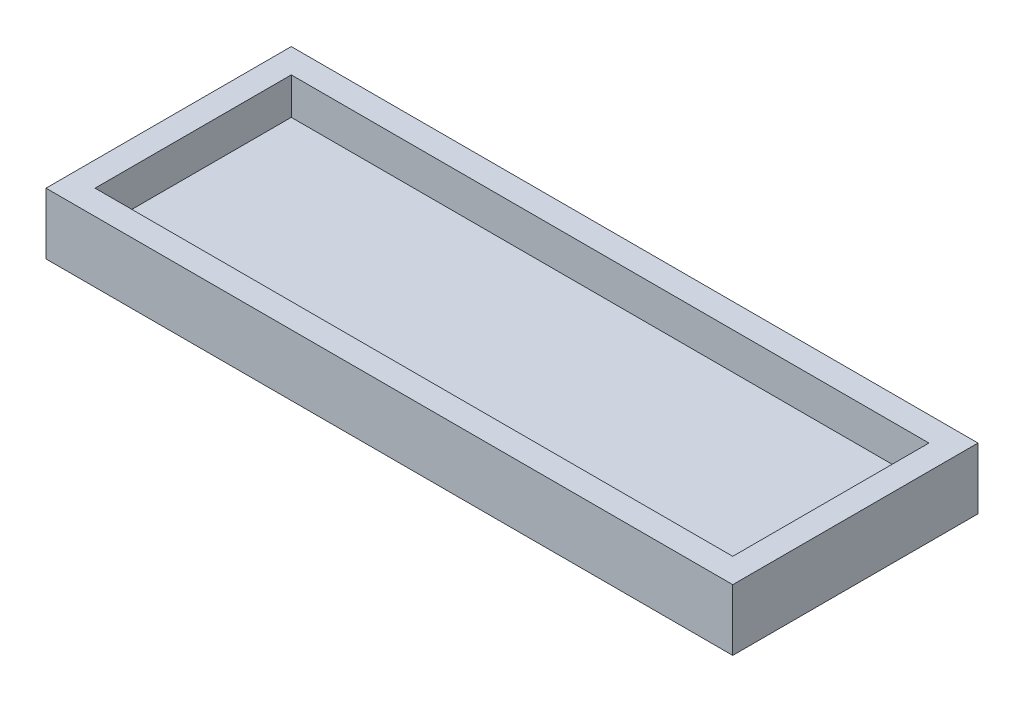
ISO-10303-21;
HEADER;
FILE_DESCRIPTION(('STEP AP214'),'2;1');
FILE_NAME('part.step','',(''),(''),'','','');
FILE_SCHEMA(('AUTOMOTIVE_DESIGN { 1 0 10303 214 1 1 1 1 }'));
ENDSEC;
DATA;
#1=APPLICATION_CONTEXT('core data for automotive mechanical design processes');
#2=APPLICATION_PROTOCOL_DEFINITION('international standard','automotive_design',2000,#1);
#3=PRODUCT_CONTEXT('',#1,'mechanical');
#4=PRODUCT('Part','Part','',(#3));
#5=PRODUCT_RELATED_PRODUCT_CATEGORY('part','',(#4));
#6=PRODUCT_DEFINITION_FORMATION('','',#4);
#7=PRODUCT_DEFINITION_CONTEXT('part definition',#1,'design');
#8=PRODUCT_DEFINITION('design','',#6,#7);
#9=PRODUCT_DEFINITION_SHAPE('','',#8);
#10=(LENGTH_UNIT() NAMED_UNIT(*) SI_UNIT(.MILLI.,.METRE.));
#11=(NAMED_UNIT(*) PLANE_ANGLE_UNIT() SI_UNIT($,.RADIAN.));
#12=(NAMED_UNIT(*) SI_UNIT($,.STERADIAN.) SOLID_ANGLE_UNIT());
#13=UNCERTAINTY_MEASURE_WITH_UNIT(LENGTH_MEASURE(1.E-05),#10,'distance_accuracy_value','');
#14=(GEOMETRIC_REPRESENTATION_CONTEXT(3) GLOBAL_UNCERTAINTY_ASSIGNED_CONTEXT((#13)) GLOBAL_UNIT_ASSIGNED_CONTEXT((#10,
#11,#12)) REPRESENTATION_CONTEXT('',''));
#15=CARTESIAN_POINT('',(0.,0.,0.));
#16=DIRECTION('',(0.,0.,1.));
#17=DIRECTION('',(1.,0.,0.));
#18=AXIS2_PLACEMENT_3D('',#15,#16,#17);
#19=CARTESIAN_POINT('',(0.,1.,0.));
#20=DIRECTION('',(0.,-1.,0.));
#21=DIRECTION('',(0.,0.,-1.));
#22=AXIS2_PLACEMENT_3D('',#19,#20,#21);
#23=PLANE('',#22);
#24=DIRECTION('',(0.,0.,-1.));
#25=VECTOR('',#24,1.);
#26=CARTESIAN_POINT('',(13.,1.,4.));
#27=LINE('',#26,#25);
#28=CARTESIAN_POINT('',(13.,1.,4.));
#29=VERTEX_POINT('',#28);
#30=CARTESIAN_POINT('',(13.,1.,-4.));
#31=VERTEX_POINT('',#30);
#32=EDGE_CURVE('E103',#29,#31,#27,.T.);
#33=ORIENTED_EDGE('',*,*,#32,.T.);
#34=DIRECTION('',(-1.,0.,0.));
#35=VECTOR('',#34,1.);
#36=CARTESIAN_POINT('',(-13.,1.,-4.));
#37=LINE('',#36,#35);
#38=CARTESIAN_POINT('',(-13.,1.,-4.));
#39=VERTEX_POINT('',#38);
#40=EDGE_CURVE('E158',#31,#39,#37,.T.);
#41=ORIENTED_EDGE('',*,*,#40,.T.);
#42=DIRECTION('',(0.,0.,1.));
#43=VECTOR('',#42,1.);
#44=CARTESIAN_POINT('',(-13.,1.,4.));
#45=LINE('',#44,#43);
#46=CARTESIAN_POINT('',(-13.,1.,4.));
#47=VERTEX_POINT('',#46);
#48=EDGE_CURVE('E43',#39,#47,#45,.T.);
#49=ORIENTED_EDGE('',*,*,#48,.T.);
#50=DIRECTION('',(1.,0.,0.));
#51=VECTOR('',#50,1.);
#52=CARTESIAN_POINT('',(-13.,1.,4.));
#53=LINE('',#52,#51);
#54=EDGE_CURVE('E11',#47,#29,#53,.T.);
#55=ORIENTED_EDGE('',*,*,#54,.T.);
#56=EDGE_LOOP('',(#33,#41,#49,#55));
#57=FACE_BOUND('',#56,.T.);
#58=ADVANCED_FACE('F35',(#57),#23,.F.);
#59=CARTESIAN_POINT('',(-13.,0.,4.));
#60=DIRECTION('',(0.,0.,1.));
#61=DIRECTION('',(1.,0.,0.));
#62=AXIS2_PLACEMENT_3D('',#59,#60,#61);
#63=PLANE('',#62);
#64=DIRECTION('',(0.,1.,0.));
#65=VECTOR('',#64,1.);
#66=CARTESIAN_POINT('',(13.,0.,4.));
#67=LINE('',#66,#65);
#68=CARTESIAN_POINT('',(13.,2.5,4.));
#69=VERTEX_POINT('',#68);
#70=EDGE_CURVE('E96',#29,#69,#67,.T.);
#71=ORIENTED_EDGE('',*,*,#70,.F.);
#72=ORIENTED_EDGE('',*,*,#54,.F.);
#73=DIRECTION('',(0.,1.,0.));
#74=VECTOR('',#73,1.);
#75=CARTESIAN_POINT('',(-13.,0.,4.));
#76=LINE('',#75,#74);
#77=CARTESIAN_POINT('',(-13.,2.5,4.));
#78=VERTEX_POINT('',#77);
#79=EDGE_CURVE('E109',#47,#78,#76,.T.);
#80=ORIENTED_EDGE('',*,*,#79,.T.);
#81=DIRECTION('',(1.,0.,0.));
#82=VECTOR('',#81,1.);
#83=CARTESIAN_POINT('',(-13.,2.5,4.));
#84=LINE('',#83,#82);
#85=EDGE_CURVE('E107',#78,#69,#84,.T.);
#86=ORIENTED_EDGE('',*,*,#85,.T.);
#87=EDGE_LOOP('',(#71,#72,#80,#86));
#88=FACE_BOUND('',#87,.T.);
#89=ADVANCED_FACE('F108',(#88),#63,.F.);
#90=CARTESIAN_POINT('',(-13.,0.,-4.));
#91=DIRECTION('',(-1.,0.,0.));
#92=DIRECTION('',(0.,0.,1.));
#93=AXIS2_PLACEMENT_3D('',#90,#91,#92);
#94=PLANE('',#93);
#95=ORIENTED_EDGE('',*,*,#79,.F.);
#96=ORIENTED_EDGE('',*,*,#48,.F.);
#97=DIRECTION('',(0.,1.,0.));
#98=VECTOR('',#97,1.);
#99=CARTESIAN_POINT('',(-13.,0.,-4.));
#100=LINE('',#99,#98);
#101=CARTESIAN_POINT('',(-13.,2.5,-4.));
#102=VERTEX_POINT('',#101);
#103=EDGE_CURVE('E135',#39,#102,#100,.T.);
#104=ORIENTED_EDGE('',*,*,#103,.T.);
#105=DIRECTION('',(0.,0.,1.));
#106=VECTOR('',#105,1.);
#107=CARTESIAN_POINT('',(-13.,2.5,-4.));
#108=LINE('',#107,#106);
#109=EDGE_CURVE('E118',#102,#78,#108,.T.);
#110=ORIENTED_EDGE('',*,*,#109,.T.);
#111=EDGE_LOOP('',(#95,#96,#104,#110));
#112=FACE_BOUND('',#111,.T.);
#113=ADVANCED_FACE('F164',(#112),#94,.F.);
#114=CARTESIAN_POINT('',(13.,0.,-4.));
#115=DIRECTION('',(0.,0.,-1.));
#116=DIRECTION('',(-1.,0.,0.));
#117=AXIS2_PLACEMENT_3D('',#114,#115,#116);
#118=PLANE('',#117);
#119=ORIENTED_EDGE('',*,*,#103,.F.);
#120=ORIENTED_EDGE('',*,*,#40,.F.);
#121=DIRECTION('',(0.,1.,0.));
#122=VECTOR('',#121,1.);
#123=CARTESIAN_POINT('',(13.,0.,-4.));
#124=LINE('',#123,#122);
#125=CARTESIAN_POINT('',(13.,2.5,-4.));
#126=VERTEX_POINT('',#125);
#127=EDGE_CURVE('E50',#31,#126,#124,.T.);
#128=ORIENTED_EDGE('',*,*,#127,.T.);
#129=DIRECTION('',(-1.,0.,0.));
#130=VECTOR('',#129,1.);
#131=CARTESIAN_POINT('',(13.,2.5,-4.));
#132=LINE('',#131,#130);
#133=EDGE_CURVE('E116',#126,#102,#132,.T.);
#134=ORIENTED_EDGE('',*,*,#133,.T.);
#135=EDGE_LOOP('',(#119,#120,#128,#134));
#136=FACE_BOUND('',#135,.T.);
#137=ADVANCED_FACE('F166',(#136),#118,.F.);
#138=CARTESIAN_POINT('',(13.,0.,4.));
#139=DIRECTION('',(1.,0.,0.));
#140=DIRECTION('',(0.,0.,-1.));
#141=AXIS2_PLACEMENT_3D('',#138,#139,#140);
#142=PLANE('',#141);
#143=ORIENTED_EDGE('',*,*,#127,.F.);
#144=ORIENTED_EDGE('',*,*,#32,.F.);
#145=ORIENTED_EDGE('',*,*,#70,.T.);
#146=DIRECTION('',(0.,0.,-1.));
#147=VECTOR('',#146,1.);
#148=CARTESIAN_POINT('',(13.,2.5,4.));
#149=LINE('',#148,#147);
#150=EDGE_CURVE('E100',#69,#126,#149,.T.);
#151=ORIENTED_EDGE('',*,*,#150,.T.);
#152=EDGE_LOOP('',(#143,#144,#145,#151));
#153=FACE_BOUND('',#152,.T.);
#154=ADVANCED_FACE('F98',(#153),#142,.F.);
#155=CARTESIAN_POINT('',(-14.,0.,5.));
#156=DIRECTION('',(0.,0.,1.));
#157=DIRECTION('',(1.,0.,0.));
#158=AXIS2_PLACEMENT_3D('',#155,#156,#157);
#159=PLANE('',#158);
#160=DIRECTION('',(0.,1.,0.));
#161=VECTOR('',#160,1.);
#162=CARTESIAN_POINT('',(14.,0.,5.));
#163=LINE('',#162,#161);
#164=CARTESIAN_POINT('',(14.,0.,5.));
#165=VERTEX_POINT('',#164);
#166=CARTESIAN_POINT('',(14.,2.5,5.));
#167=VERTEX_POINT('',#166);
#168=EDGE_CURVE('E149',#165,#167,#163,.T.);
#169=ORIENTED_EDGE('',*,*,#168,.T.);
#170=DIRECTION('',(1.,0.,0.));
#171=VECTOR('',#170,1.);
#172=CARTESIAN_POINT('',(-14.,2.5,5.));
#173=LINE('',#172,#171);
#174=CARTESIAN_POINT('',(-14.,2.5,5.));
#175=VERTEX_POINT('',#174);
#176=EDGE_CURVE('E122',#175,#167,#173,.T.);
#177=ORIENTED_EDGE('',*,*,#176,.F.);
#178=DIRECTION('',(0.,1.,0.));
#179=VECTOR('',#178,1.);
#180=CARTESIAN_POINT('',(-14.,0.,5.));
#181=LINE('',#180,#179);
#182=CARTESIAN_POINT('',(-14.,0.,5.));
#183=VERTEX_POINT('',#182);
#184=EDGE_CURVE('E150',#183,#175,#181,.T.);
#185=ORIENTED_EDGE('',*,*,#184,.F.);
#186=DIRECTION('',(1.,0.,0.));
#187=VECTOR('',#186,1.);
#188=CARTESIAN_POINT('',(-14.,0.,5.));
#189=LINE('',#188,#187);
#190=EDGE_CURVE('E134',#183,#165,#189,.T.);
#191=ORIENTED_EDGE('',*,*,#190,.T.);
#192=EDGE_LOOP('',(#169,#177,#185,#191));
#193=FACE_BOUND('',#192,.T.);
#194=ADVANCED_FACE('F173',(#193),#159,.T.);
#195=CARTESIAN_POINT('',(-14.,0.,-5.));
#196=DIRECTION('',(-1.,0.,0.));
#197=DIRECTION('',(0.,0.,1.));
#198=AXIS2_PLACEMENT_3D('',#195,#196,#197);
#199=PLANE('',#198);
#200=ORIENTED_EDGE('',*,*,#184,.T.);
#201=DIRECTION('',(0.,0.,1.));
#202=VECTOR('',#201,1.);
#203=CARTESIAN_POINT('',(-14.,2.5,-5.));
#204=LINE('',#203,#202);
#205=CARTESIAN_POINT('',(-14.,2.5,-5.));
#206=VERTEX_POINT('',#205);
#207=EDGE_CURVE('E104',#206,#175,#204,.T.);
#208=ORIENTED_EDGE('',*,*,#207,.F.);
#209=DIRECTION('',(0.,1.,0.));
#210=VECTOR('',#209,1.);
#211=CARTESIAN_POINT('',(-14.,0.,-5.));
#212=LINE('',#211,#210);
#213=CARTESIAN_POINT('',(-14.,0.,-5.));
#214=VERTEX_POINT('',#213);
#215=EDGE_CURVE('E152',#214,#206,#212,.T.);
#216=ORIENTED_EDGE('',*,*,#215,.F.);
#217=DIRECTION('',(0.,0.,1.));
#218=VECTOR('',#217,1.);
#219=CARTESIAN_POINT('',(-14.,0.,-5.));
#220=LINE('',#219,#218);
#221=EDGE_CURVE('E146',#214,#183,#220,.T.);
#222=ORIENTED_EDGE('',*,*,#221,.T.);
#223=EDGE_LOOP('',(#200,#208,#216,#222));
#224=FACE_BOUND('',#223,.T.);
#225=ADVANCED_FACE('F184',(#224),#199,.T.);
#226=CARTESIAN_POINT('',(14.,0.,-5.));
#227=DIRECTION('',(0.,0.,-1.));
#228=DIRECTION('',(-1.,0.,0.));
#229=AXIS2_PLACEMENT_3D('',#226,#227,#228);
#230=PLANE('',#229);
#231=ORIENTED_EDGE('',*,*,#215,.T.);
#232=DIRECTION('',(-1.,0.,0.));
#233=VECTOR('',#232,1.);
#234=CARTESIAN_POINT('',(14.,2.5,-5.));
#235=LINE('',#234,#233);
#236=CARTESIAN_POINT('',(14.,2.5,-5.));
#237=VERTEX_POINT('',#236);
#238=EDGE_CURVE('E128',#237,#206,#235,.T.);
#239=ORIENTED_EDGE('',*,*,#238,.F.);
#240=DIRECTION('',(0.,1.,0.));
#241=VECTOR('',#240,1.);
#242=CARTESIAN_POINT('',(14.,0.,-5.));
#243=LINE('',#242,#241);
#244=CARTESIAN_POINT('',(14.,0.,-5.));
#245=VERTEX_POINT('',#244);
#246=EDGE_CURVE('E154',#245,#237,#243,.T.);
#247=ORIENTED_EDGE('',*,*,#246,.F.);
#248=DIRECTION('',(-1.,0.,0.));
#249=VECTOR('',#248,1.);
#250=CARTESIAN_POINT('',(14.,0.,-5.));
#251=LINE('',#250,#249);
#252=EDGE_CURVE('E143',#245,#214,#251,.T.);
#253=ORIENTED_EDGE('',*,*,#252,.T.);
#254=EDGE_LOOP('',(#231,#239,#247,#253));
#255=FACE_BOUND('',#254,.T.);
#256=ADVANCED_FACE('F189',(#255),#230,.T.);
#257=CARTESIAN_POINT('',(14.,0.,5.));
#258=DIRECTION('',(1.,0.,0.));
#259=DIRECTION('',(0.,0.,-1.));
#260=AXIS2_PLACEMENT_3D('',#257,#258,#259);
#261=PLANE('',#260);
#262=ORIENTED_EDGE('',*,*,#246,.T.);
#263=DIRECTION('',(0.,0.,-1.));
#264=VECTOR('',#263,1.);
#265=CARTESIAN_POINT('',(14.,2.5,5.));
#266=LINE('',#265,#264);
#267=EDGE_CURVE('E125',#167,#237,#266,.T.);
#268=ORIENTED_EDGE('',*,*,#267,.F.);
#269=ORIENTED_EDGE('',*,*,#168,.F.);
#270=DIRECTION('',(0.,0.,-1.));
#271=VECTOR('',#270,1.);
#272=CARTESIAN_POINT('',(14.,0.,5.));
#273=LINE('',#272,#271);
#274=EDGE_CURVE('E140',#165,#245,#273,.T.);
#275=ORIENTED_EDGE('',*,*,#274,.T.);
#276=EDGE_LOOP('',(#262,#268,#269,#275));
#277=FACE_BOUND('',#276,.T.);
#278=ADVANCED_FACE('F186',(#277),#261,.T.);
#279=CARTESIAN_POINT('',(0.,2.5,0.));
#280=DIRECTION('',(0.,1.,0.));
#281=DIRECTION('',(0.,0.,1.));
#282=AXIS2_PLACEMENT_3D('',#279,#280,#281);
#283=PLANE('',#282);
#284=ORIENTED_EDGE('',*,*,#176,.T.);
#285=ORIENTED_EDGE('',*,*,#267,.T.);
#286=ORIENTED_EDGE('',*,*,#238,.T.);
#287=ORIENTED_EDGE('',*,*,#207,.T.);
#288=EDGE_LOOP('',(#284,#285,#286,#287));
#289=FACE_BOUND('',#288,.T.);
#290=ORIENTED_EDGE('',*,*,#150,.F.);
#291=ORIENTED_EDGE('',*,*,#85,.F.);
#292=ORIENTED_EDGE('',*,*,#109,.F.);
#293=ORIENTED_EDGE('',*,*,#133,.F.);
#294=EDGE_LOOP('',(#290,#291,#292,#293));
#295=FACE_BOUND('',#294,.T.);
#296=ADVANCED_FACE('F114',(#289,#295),#283,.T.);
#297=CARTESIAN_POINT('',(0.,0.,0.));
#298=DIRECTION('',(0.,-1.,0.));
#299=DIRECTION('',(0.,0.,-1.));
#300=AXIS2_PLACEMENT_3D('',#297,#298,#299);
#301=PLANE('',#300);
#302=ORIENTED_EDGE('',*,*,#190,.F.);
#303=ORIENTED_EDGE('',*,*,#221,.F.);
#304=ORIENTED_EDGE('',*,*,#252,.F.);
#305=ORIENTED_EDGE('',*,*,#274,.F.);
#306=EDGE_LOOP('',(#302,#303,#304,#305));
#307=FACE_BOUND('',#306,.T.);
#308=ADVANCED_FACE('F37',(#307),#301,.T.);
#309=CLOSED_SHELL('',(#58,#89,#113,#137,#154,#194,#225,#256,#278,#296,#308));
#310=MANIFOLD_SOLID_BREP('B2',#309);
#311=ADVANCED_BREP_SHAPE_REPRESENTATION('',(#18,#310),#14);
#312=SHAPE_DEFINITION_REPRESENTATION(#9,#311);
ENDSEC;
END-ISO-10303-21;
